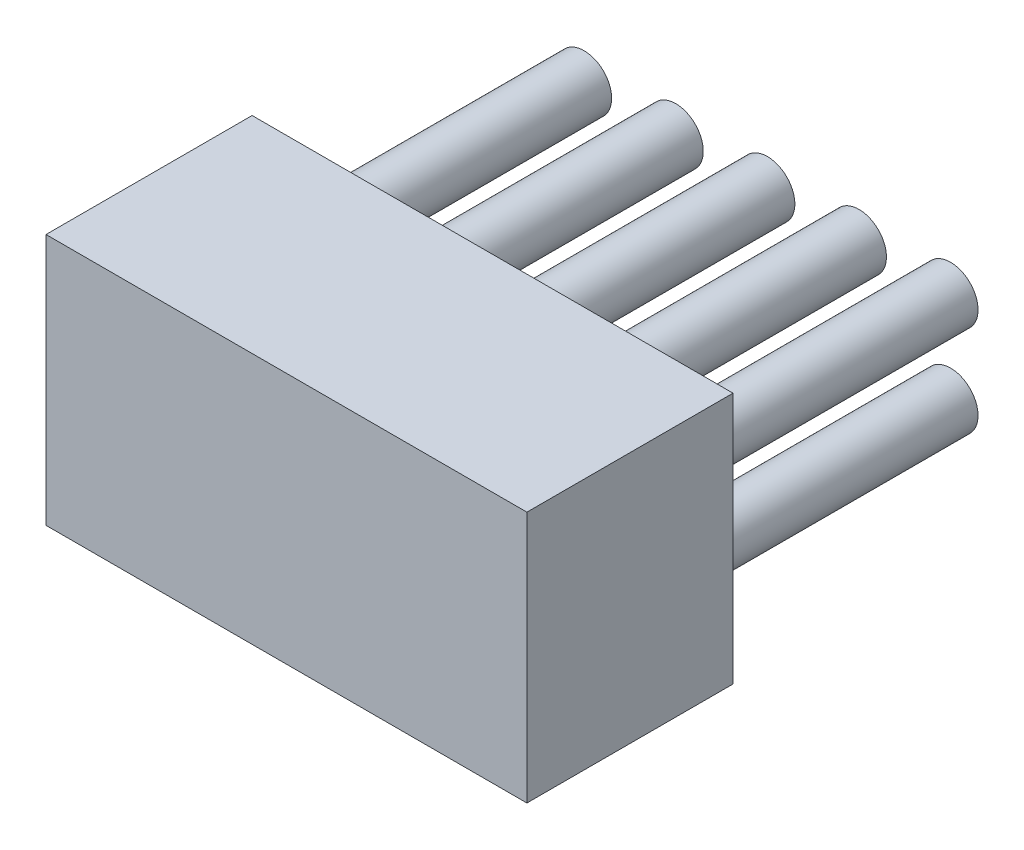
ISO-10303-21;
HEADER;
FILE_DESCRIPTION(('STEP AP214'),'2;1');
FILE_NAME('part.step','',(''),(''),'','','');
FILE_SCHEMA(('AUTOMOTIVE_DESIGN { 1 0 10303 214 1 1 1 1 }'));
ENDSEC;
DATA;
#1=APPLICATION_CONTEXT('core data for automotive mechanical design processes');
#2=APPLICATION_PROTOCOL_DEFINITION('international standard','automotive_design',2000,#1);
#3=PRODUCT_CONTEXT('',#1,'mechanical');
#4=PRODUCT('Part','Part','',(#3));
#5=PRODUCT_RELATED_PRODUCT_CATEGORY('part','',(#4));
#6=PRODUCT_DEFINITION_FORMATION('','',#4);
#7=PRODUCT_DEFINITION_CONTEXT('part definition',#1,'design');
#8=PRODUCT_DEFINITION('design','',#6,#7);
#9=PRODUCT_DEFINITION_SHAPE('','',#8);
#10=(LENGTH_UNIT() NAMED_UNIT(*) SI_UNIT(.MILLI.,.METRE.));
#11=(NAMED_UNIT(*) PLANE_ANGLE_UNIT() SI_UNIT($,.RADIAN.));
#12=(NAMED_UNIT(*) SI_UNIT($,.STERADIAN.) SOLID_ANGLE_UNIT());
#13=UNCERTAINTY_MEASURE_WITH_UNIT(LENGTH_MEASURE(1.E-05),#10,'distance_accuracy_value','');
#14=(GEOMETRIC_REPRESENTATION_CONTEXT(3) GLOBAL_UNCERTAINTY_ASSIGNED_CONTEXT((#13)) GLOBAL_UNIT_ASSIGNED_CONTEXT((#10,
#11,#12)) REPRESENTATION_CONTEXT('',''));
#15=CARTESIAN_POINT('',(0.,0.,0.));
#16=DIRECTION('',(0.,0.,1.));
#17=DIRECTION('',(1.,0.,0.));
#18=AXIS2_PLACEMENT_3D('',#15,#16,#17);
#19=CARTESIAN_POINT('',(0.,0.,4.5));
#20=DIRECTION('',(1.,0.,0.));
#21=DIRECTION('',(0.,0.,-1.));
#22=AXIS2_PLACEMENT_3D('',#19,#20,#21);
#23=PLANE('',#22);
#24=DIRECTION('',(0.,-1.,0.));
#25=VECTOR('',#24,1.);
#26=CARTESIAN_POINT('',(0.,0.,0.));
#27=LINE('',#26,#25);
#28=CARTESIAN_POINT('',(0.,5.5,0.));
#29=VERTEX_POINT('',#28);
#30=CARTESIAN_POINT('',(0.,0.,0.));
#31=VERTEX_POINT('',#30);
#32=EDGE_CURVE('E97',#29,#31,#27,.T.);
#33=ORIENTED_EDGE('',*,*,#32,.T.);
#34=DIRECTION('',(0.,0.,-1.));
#35=VECTOR('',#34,1.);
#36=CARTESIAN_POINT('',(0.,0.,4.5));
#37=LINE('',#36,#35);
#38=CARTESIAN_POINT('',(0.,0.,4.5));
#39=VERTEX_POINT('',#38);
#40=EDGE_CURVE('E11',#39,#31,#37,.T.);
#41=ORIENTED_EDGE('',*,*,#40,.F.);
#42=DIRECTION('',(0.,-1.,0.));
#43=VECTOR('',#42,1.);
#44=CARTESIAN_POINT('',(0.,0.,4.5));
#45=LINE('',#44,#43);
#46=CARTESIAN_POINT('',(0.,5.5,4.5));
#47=VERTEX_POINT('',#46);
#48=EDGE_CURVE('E85',#47,#39,#45,.T.);
#49=ORIENTED_EDGE('',*,*,#48,.F.);
#50=DIRECTION('',(0.,0.,-1.));
#51=VECTOR('',#50,1.);
#52=CARTESIAN_POINT('',(0.,5.5,4.5));
#53=LINE('',#52,#51);
#54=EDGE_CURVE('E93',#47,#29,#53,.T.);
#55=ORIENTED_EDGE('',*,*,#54,.T.);
#56=EDGE_LOOP('',(#33,#41,#49,#55));
#57=FACE_BOUND('',#56,.T.);
#58=ADVANCED_FACE('F34',(#57),#23,.F.);
#59=CARTESIAN_POINT('',(0.,0.,4.5));
#60=DIRECTION('',(0.,1.,0.));
#61=DIRECTION('',(0.,0.,1.));
#62=AXIS2_PLACEMENT_3D('',#59,#60,#61);
#63=PLANE('',#62);
#64=DIRECTION('',(1.,0.,0.));
#65=VECTOR('',#64,1.);
#66=CARTESIAN_POINT('',(0.,0.,0.));
#67=LINE('',#66,#65);
#68=CARTESIAN_POINT('',(10.5,0.,0.));
#69=VERTEX_POINT('',#68);
#70=EDGE_CURVE('E89',#31,#69,#67,.T.);
#71=ORIENTED_EDGE('',*,*,#70,.T.);
#72=DIRECTION('',(0.,0.,-1.));
#73=VECTOR('',#72,1.);
#74=CARTESIAN_POINT('',(10.5,0.,4.5));
#75=LINE('',#74,#73);
#76=CARTESIAN_POINT('',(10.5,0.,4.5));
#77=VERTEX_POINT('',#76);
#78=EDGE_CURVE('E42',#77,#69,#75,.T.);
#79=ORIENTED_EDGE('',*,*,#78,.F.);
#80=DIRECTION('',(1.,0.,0.));
#81=VECTOR('',#80,1.);
#82=CARTESIAN_POINT('',(0.,0.,4.5));
#83=LINE('',#82,#81);
#84=EDGE_CURVE('E80',#39,#77,#83,.T.);
#85=ORIENTED_EDGE('',*,*,#84,.F.);
#86=ORIENTED_EDGE('',*,*,#40,.T.);
#87=EDGE_LOOP('',(#71,#79,#85,#86));
#88=FACE_BOUND('',#87,.T.);
#89=ADVANCED_FACE('F88',(#88),#63,.F.);
#90=CARTESIAN_POINT('',(10.5,0.,4.5));
#91=DIRECTION('',(-1.,0.,0.));
#92=DIRECTION('',(0.,0.,1.));
#93=AXIS2_PLACEMENT_3D('',#90,#91,#92);
#94=PLANE('',#93);
#95=DIRECTION('',(0.,1.,0.));
#96=VECTOR('',#95,1.);
#97=CARTESIAN_POINT('',(10.5,0.,0.));
#98=LINE('',#97,#96);
#99=CARTESIAN_POINT('',(10.5,5.5,0.));
#100=VERTEX_POINT('',#99);
#101=EDGE_CURVE('E67',#69,#100,#98,.T.);
#102=ORIENTED_EDGE('',*,*,#101,.T.);
#103=DIRECTION('',(0.,0.,-1.));
#104=VECTOR('',#103,1.);
#105=CARTESIAN_POINT('',(10.5,5.5,4.5));
#106=LINE('',#105,#104);
#107=CARTESIAN_POINT('',(10.5,5.5,4.5));
#108=VERTEX_POINT('',#107);
#109=EDGE_CURVE('E90',#108,#100,#106,.T.);
#110=ORIENTED_EDGE('',*,*,#109,.F.);
#111=DIRECTION('',(0.,1.,0.));
#112=VECTOR('',#111,1.);
#113=CARTESIAN_POINT('',(10.5,0.,4.5));
#114=LINE('',#113,#112);
#115=EDGE_CURVE('E83',#77,#108,#114,.T.);
#116=ORIENTED_EDGE('',*,*,#115,.F.);
#117=ORIENTED_EDGE('',*,*,#78,.T.);
#118=EDGE_LOOP('',(#102,#110,#116,#117));
#119=FACE_BOUND('',#118,.T.);
#120=ADVANCED_FACE('F91',(#119),#94,.F.);
#121=CARTESIAN_POINT('',(0.,5.5,4.5));
#122=DIRECTION('',(0.,-1.,0.));
#123=DIRECTION('',(0.,0.,-1.));
#124=AXIS2_PLACEMENT_3D('',#121,#122,#123);
#125=PLANE('',#124);
#126=DIRECTION('',(-1.,0.,0.));
#127=VECTOR('',#126,1.);
#128=CARTESIAN_POINT('',(0.,5.5,0.));
#129=LINE('',#128,#127);
#130=EDGE_CURVE('E73',#100,#29,#129,.T.);
#131=ORIENTED_EDGE('',*,*,#130,.T.);
#132=ORIENTED_EDGE('',*,*,#54,.F.);
#133=DIRECTION('',(-1.,0.,0.));
#134=VECTOR('',#133,1.);
#135=CARTESIAN_POINT('',(0.,5.5,4.5));
#136=LINE('',#135,#134);
#137=EDGE_CURVE('E50',#108,#47,#136,.T.);
#138=ORIENTED_EDGE('',*,*,#137,.F.);
#139=ORIENTED_EDGE('',*,*,#109,.T.);
#140=EDGE_LOOP('',(#131,#132,#138,#139));
#141=FACE_BOUND('',#140,.T.);
#142=ADVANCED_FACE('F105',(#141),#125,.F.);
#143=CARTESIAN_POINT('',(0.,0.,4.5));
#144=DIRECTION('',(0.,0.,-1.));
#145=DIRECTION('',(-1.,0.,0.));
#146=AXIS2_PLACEMENT_3D('',#143,#144,#145);
#147=PLANE('',#146);
#148=ORIENTED_EDGE('',*,*,#48,.T.);
#149=ORIENTED_EDGE('',*,*,#84,.T.);
#150=ORIENTED_EDGE('',*,*,#115,.T.);
#151=ORIENTED_EDGE('',*,*,#137,.T.);
#152=EDGE_LOOP('',(#148,#149,#150,#151));
#153=FACE_BOUND('',#152,.T.);
#154=ADVANCED_FACE('F81',(#153),#147,.F.);
#155=CARTESIAN_POINT('',(0.,0.,0.));
#156=DIRECTION('',(0.,0.,-1.));
#157=DIRECTION('',(-1.,0.,0.));
#158=AXIS2_PLACEMENT_3D('',#155,#156,#157);
#159=PLANE('',#158);
#160=CARTESIAN_POINT('',(3.25,1.75,0.));
#161=DIRECTION('',(0.,0.,-1.));
#162=DIRECTION('',(-1.,0.,0.));
#163=AXIS2_PLACEMENT_3D('',#160,#161,#162);
#164=CIRCLE('',#163,0.6);
#165=CARTESIAN_POINT('',(2.65,1.75,0.));
#166=VERTEX_POINT('',#165);
#167=EDGE_CURVE('E165',#166,#166,#164,.T.);
#168=ORIENTED_EDGE('',*,*,#167,.F.);
#169=EDGE_LOOP('',(#168));
#170=FACE_BOUND('',#169,.T.);
#171=CARTESIAN_POINT('',(1.25,1.75,0.));
#172=DIRECTION('',(0.,0.,-1.));
#173=DIRECTION('',(-1.,0.,0.));
#174=AXIS2_PLACEMENT_3D('',#171,#172,#173);
#175=CIRCLE('',#174,0.6);
#176=CARTESIAN_POINT('',(0.649999999999999,1.75,0.));
#177=VERTEX_POINT('',#176);
#178=EDGE_CURVE('E159',#177,#177,#175,.T.);
#179=ORIENTED_EDGE('',*,*,#178,.F.);
#180=EDGE_LOOP('',(#179));
#181=FACE_BOUND('',#180,.T.);
#182=CARTESIAN_POINT('',(1.25,3.75,0.));
#183=DIRECTION('',(0.,0.,-1.));
#184=DIRECTION('',(-1.,0.,0.));
#185=AXIS2_PLACEMENT_3D('',#182,#183,#184);
#186=CIRCLE('',#185,0.6);
#187=CARTESIAN_POINT('',(0.649999999999999,3.75,0.));
#188=VERTEX_POINT('',#187);
#189=EDGE_CURVE('E153',#188,#188,#186,.T.);
#190=ORIENTED_EDGE('',*,*,#189,.F.);
#191=EDGE_LOOP('',(#190));
#192=FACE_BOUND('',#191,.T.);
#193=CARTESIAN_POINT('',(3.25,3.75,0.));
#194=DIRECTION('',(0.,0.,-1.));
#195=DIRECTION('',(-1.,0.,0.));
#196=AXIS2_PLACEMENT_3D('',#193,#194,#195);
#197=CIRCLE('',#196,0.6);
#198=CARTESIAN_POINT('',(2.65,3.75,0.));
#199=VERTEX_POINT('',#198);
#200=EDGE_CURVE('E147',#199,#199,#197,.T.);
#201=ORIENTED_EDGE('',*,*,#200,.F.);
#202=EDGE_LOOP('',(#201));
#203=FACE_BOUND('',#202,.T.);
#204=CARTESIAN_POINT('',(5.25,3.75,0.));
#205=DIRECTION('',(0.,0.,-1.));
#206=DIRECTION('',(-1.,0.,0.));
#207=AXIS2_PLACEMENT_3D('',#204,#205,#206);
#208=CIRCLE('',#207,0.6);
#209=CARTESIAN_POINT('',(4.65,3.75,0.));
#210=VERTEX_POINT('',#209);
#211=EDGE_CURVE('E141',#210,#210,#208,.T.);
#212=ORIENTED_EDGE('',*,*,#211,.F.);
#213=EDGE_LOOP('',(#212));
#214=FACE_BOUND('',#213,.T.);
#215=CARTESIAN_POINT('',(7.25,3.75,0.));
#216=DIRECTION('',(0.,0.,-1.));
#217=DIRECTION('',(-1.,0.,0.));
#218=AXIS2_PLACEMENT_3D('',#215,#216,#217);
#219=CIRCLE('',#218,0.6);
#220=CARTESIAN_POINT('',(6.65,3.75,0.));
#221=VERTEX_POINT('',#220);
#222=EDGE_CURVE('E135',#221,#221,#219,.T.);
#223=ORIENTED_EDGE('',*,*,#222,.F.);
#224=EDGE_LOOP('',(#223));
#225=FACE_BOUND('',#224,.T.);
#226=CARTESIAN_POINT('',(7.25,1.75,0.));
#227=DIRECTION('',(0.,0.,-1.));
#228=DIRECTION('',(-1.,0.,0.));
#229=AXIS2_PLACEMENT_3D('',#226,#227,#228);
#230=CIRCLE('',#229,0.6);
#231=CARTESIAN_POINT('',(6.65,1.75,0.));
#232=VERTEX_POINT('',#231);
#233=EDGE_CURVE('E129',#232,#232,#230,.T.);
#234=ORIENTED_EDGE('',*,*,#233,.F.);
#235=EDGE_LOOP('',(#234));
#236=FACE_BOUND('',#235,.T.);
#237=CARTESIAN_POINT('',(5.25,1.75,0.));
#238=DIRECTION('',(0.,0.,-1.));
#239=DIRECTION('',(-1.,0.,0.));
#240=AXIS2_PLACEMENT_3D('',#237,#238,#239);
#241=CIRCLE('',#240,0.6);
#242=CARTESIAN_POINT('',(4.65,1.75,0.));
#243=VERTEX_POINT('',#242);
#244=EDGE_CURVE('E123',#243,#243,#241,.T.);
#245=ORIENTED_EDGE('',*,*,#244,.F.);
#246=EDGE_LOOP('',(#245));
#247=FACE_BOUND('',#246,.T.);
#248=CARTESIAN_POINT('',(9.25,3.75,0.));
#249=DIRECTION('',(0.,0.,-1.));
#250=DIRECTION('',(-1.,0.,0.));
#251=AXIS2_PLACEMENT_3D('',#248,#249,#250);
#252=CIRCLE('',#251,0.6);
#253=CARTESIAN_POINT('',(8.65,3.75,0.));
#254=VERTEX_POINT('',#253);
#255=EDGE_CURVE('E117',#254,#254,#252,.T.);
#256=ORIENTED_EDGE('',*,*,#255,.F.);
#257=EDGE_LOOP('',(#256));
#258=FACE_BOUND('',#257,.T.);
#259=CARTESIAN_POINT('',(9.25,1.75,0.));
#260=DIRECTION('',(0.,0.,-1.));
#261=DIRECTION('',(-1.,0.,0.));
#262=AXIS2_PLACEMENT_3D('',#259,#260,#261);
#263=CIRCLE('',#262,0.6);
#264=CARTESIAN_POINT('',(8.65,1.75,0.));
#265=VERTEX_POINT('',#264);
#266=EDGE_CURVE('E111',#265,#265,#263,.T.);
#267=ORIENTED_EDGE('',*,*,#266,.F.);
#268=EDGE_LOOP('',(#267));
#269=FACE_BOUND('',#268,.T.);
#270=ORIENTED_EDGE('',*,*,#32,.F.);
#271=ORIENTED_EDGE('',*,*,#130,.F.);
#272=ORIENTED_EDGE('',*,*,#101,.F.);
#273=ORIENTED_EDGE('',*,*,#70,.F.);
#274=EDGE_LOOP('',(#270,#271,#272,#273));
#275=FACE_BOUND('',#274,.T.);
#276=ADVANCED_FACE('F108',(#170,#181,#192,#203,#214,#225,#236,#247,#258,#269,#275),#159,.T.);
#277=CARTESIAN_POINT('',(9.25,1.75,-6.));
#278=DIRECTION('',(0.,0.,1.));
#279=DIRECTION('',(1.,0.,0.));
#280=AXIS2_PLACEMENT_3D('',#277,#278,#279);
#281=CYLINDRICAL_SURFACE('',#280,0.6);
#282=CARTESIAN_POINT('',(9.25,1.75,-6.));
#283=DIRECTION('',(0.,0.,-1.));
#284=DIRECTION('',(-1.,0.,0.));
#285=AXIS2_PLACEMENT_3D('',#282,#283,#284);
#286=CIRCLE('',#285,0.6);
#287=CARTESIAN_POINT('',(8.65,1.75,-6.));
#288=VERTEX_POINT('',#287);
#289=EDGE_CURVE('E100',#288,#288,#286,.T.);
#290=ORIENTED_EDGE('',*,*,#289,.F.);
#291=EDGE_LOOP('',(#290));
#292=FACE_BOUND('',#291,.T.);
#293=ORIENTED_EDGE('',*,*,#266,.T.);
#294=EDGE_LOOP('',(#293));
#295=FACE_BOUND('',#294,.T.);
#296=ADVANCED_FACE('F182',(#292,#295),#281,.T.);
#297=CARTESIAN_POINT('',(9.25,1.75,-6.));
#298=DIRECTION('',(0.,0.,-1.));
#299=DIRECTION('',(-1.,0.,0.));
#300=AXIS2_PLACEMENT_3D('',#297,#298,#299);
#301=PLANE('',#300);
#302=ORIENTED_EDGE('',*,*,#289,.T.);
#303=EDGE_LOOP('',(#302));
#304=FACE_BOUND('',#303,.T.);
#305=ADVANCED_FACE('F203',(#304),#301,.T.);
#306=CARTESIAN_POINT('',(9.25,3.75,-6.));
#307=DIRECTION('',(0.,0.,1.));
#308=DIRECTION('',(1.,0.,0.));
#309=AXIS2_PLACEMENT_3D('',#306,#307,#308);
#310=CYLINDRICAL_SURFACE('',#309,0.6);
#311=CARTESIAN_POINT('',(9.25,3.75,-6.));
#312=DIRECTION('',(0.,0.,-1.));
#313=DIRECTION('',(-1.,0.,0.));
#314=AXIS2_PLACEMENT_3D('',#311,#312,#313);
#315=CIRCLE('',#314,0.6);
#316=CARTESIAN_POINT('',(8.65,3.75,-6.));
#317=VERTEX_POINT('',#316);
#318=EDGE_CURVE('E114',#317,#317,#315,.T.);
#319=ORIENTED_EDGE('',*,*,#318,.F.);
#320=EDGE_LOOP('',(#319));
#321=FACE_BOUND('',#320,.T.);
#322=ORIENTED_EDGE('',*,*,#255,.T.);
#323=EDGE_LOOP('',(#322));
#324=FACE_BOUND('',#323,.T.);
#325=ADVANCED_FACE('F209',(#321,#324),#310,.T.);
#326=CARTESIAN_POINT('',(9.25,3.75,-6.));
#327=DIRECTION('',(0.,0.,-1.));
#328=DIRECTION('',(-1.,0.,0.));
#329=AXIS2_PLACEMENT_3D('',#326,#327,#328);
#330=PLANE('',#329);
#331=ORIENTED_EDGE('',*,*,#318,.T.);
#332=EDGE_LOOP('',(#331));
#333=FACE_BOUND('',#332,.T.);
#334=ADVANCED_FACE('F252',(#333),#330,.T.);
#335=CARTESIAN_POINT('',(5.25,1.75,-6.));
#336=DIRECTION('',(0.,0.,1.));
#337=DIRECTION('',(1.,0.,0.));
#338=AXIS2_PLACEMENT_3D('',#335,#336,#337);
#339=CYLINDRICAL_SURFACE('',#338,0.6);
#340=CARTESIAN_POINT('',(5.25,1.75,-6.));
#341=DIRECTION('',(0.,0.,-1.));
#342=DIRECTION('',(-1.,0.,0.));
#343=AXIS2_PLACEMENT_3D('',#340,#341,#342);
#344=CIRCLE('',#343,0.6);
#345=CARTESIAN_POINT('',(4.65,1.75,-6.));
#346=VERTEX_POINT('',#345);
#347=EDGE_CURVE('E120',#346,#346,#344,.T.);
#348=ORIENTED_EDGE('',*,*,#347,.F.);
#349=EDGE_LOOP('',(#348));
#350=FACE_BOUND('',#349,.T.);
#351=ORIENTED_EDGE('',*,*,#244,.T.);
#352=EDGE_LOOP('',(#351));
#353=FACE_BOUND('',#352,.T.);
#354=ADVANCED_FACE('F262',(#350,#353),#339,.T.);
#355=CARTESIAN_POINT('',(5.25,1.75,-6.));
#356=DIRECTION('',(0.,0.,-1.));
#357=DIRECTION('',(-1.,0.,0.));
#358=AXIS2_PLACEMENT_3D('',#355,#356,#357);
#359=PLANE('',#358);
#360=ORIENTED_EDGE('',*,*,#347,.T.);
#361=EDGE_LOOP('',(#360));
#362=FACE_BOUND('',#361,.T.);
#363=ADVANCED_FACE('F272',(#362),#359,.T.);
#364=CARTESIAN_POINT('',(7.25,1.75,-6.));
#365=DIRECTION('',(0.,0.,1.));
#366=DIRECTION('',(1.,0.,0.));
#367=AXIS2_PLACEMENT_3D('',#364,#365,#366);
#368=CYLINDRICAL_SURFACE('',#367,0.6);
#369=CARTESIAN_POINT('',(7.25,1.75,-6.));
#370=DIRECTION('',(0.,0.,-1.));
#371=DIRECTION('',(-1.,0.,0.));
#372=AXIS2_PLACEMENT_3D('',#369,#370,#371);
#373=CIRCLE('',#372,0.6);
#374=CARTESIAN_POINT('',(6.65,1.75,-6.));
#375=VERTEX_POINT('',#374);
#376=EDGE_CURVE('E126',#375,#375,#373,.T.);
#377=ORIENTED_EDGE('',*,*,#376,.F.);
#378=EDGE_LOOP('',(#377));
#379=FACE_BOUND('',#378,.T.);
#380=ORIENTED_EDGE('',*,*,#233,.T.);
#381=EDGE_LOOP('',(#380));
#382=FACE_BOUND('',#381,.T.);
#383=ADVANCED_FACE('F282',(#379,#382),#368,.T.);
#384=CARTESIAN_POINT('',(7.25,1.75,-6.));
#385=DIRECTION('',(0.,0.,-1.));
#386=DIRECTION('',(-1.,0.,0.));
#387=AXIS2_PLACEMENT_3D('',#384,#385,#386);
#388=PLANE('',#387);
#389=ORIENTED_EDGE('',*,*,#376,.T.);
#390=EDGE_LOOP('',(#389));
#391=FACE_BOUND('',#390,.T.);
#392=ADVANCED_FACE('F292',(#391),#388,.T.);
#393=CARTESIAN_POINT('',(7.25,3.75,-6.));
#394=DIRECTION('',(0.,0.,1.));
#395=DIRECTION('',(1.,0.,0.));
#396=AXIS2_PLACEMENT_3D('',#393,#394,#395);
#397=CYLINDRICAL_SURFACE('',#396,0.6);
#398=CARTESIAN_POINT('',(7.25,3.75,-6.));
#399=DIRECTION('',(0.,0.,-1.));
#400=DIRECTION('',(-1.,0.,0.));
#401=AXIS2_PLACEMENT_3D('',#398,#399,#400);
#402=CIRCLE('',#401,0.6);
#403=CARTESIAN_POINT('',(6.65,3.75,-6.));
#404=VERTEX_POINT('',#403);
#405=EDGE_CURVE('E132',#404,#404,#402,.T.);
#406=ORIENTED_EDGE('',*,*,#405,.F.);
#407=EDGE_LOOP('',(#406));
#408=FACE_BOUND('',#407,.T.);
#409=ORIENTED_EDGE('',*,*,#222,.T.);
#410=EDGE_LOOP('',(#409));
#411=FACE_BOUND('',#410,.T.);
#412=ADVANCED_FACE('F302',(#408,#411),#397,.T.);
#413=CARTESIAN_POINT('',(7.25,3.75,-6.));
#414=DIRECTION('',(0.,0.,-1.));
#415=DIRECTION('',(-1.,0.,0.));
#416=AXIS2_PLACEMENT_3D('',#413,#414,#415);
#417=PLANE('',#416);
#418=ORIENTED_EDGE('',*,*,#405,.T.);
#419=EDGE_LOOP('',(#418));
#420=FACE_BOUND('',#419,.T.);
#421=ADVANCED_FACE('F312',(#420),#417,.T.);
#422=CARTESIAN_POINT('',(5.25,3.75,-6.));
#423=DIRECTION('',(0.,0.,1.));
#424=DIRECTION('',(1.,0.,0.));
#425=AXIS2_PLACEMENT_3D('',#422,#423,#424);
#426=CYLINDRICAL_SURFACE('',#425,0.6);
#427=CARTESIAN_POINT('',(5.25,3.75,-6.));
#428=DIRECTION('',(0.,0.,-1.));
#429=DIRECTION('',(-1.,0.,0.));
#430=AXIS2_PLACEMENT_3D('',#427,#428,#429);
#431=CIRCLE('',#430,0.6);
#432=CARTESIAN_POINT('',(4.65,3.75,-6.));
#433=VERTEX_POINT('',#432);
#434=EDGE_CURVE('E138',#433,#433,#431,.T.);
#435=ORIENTED_EDGE('',*,*,#434,.F.);
#436=EDGE_LOOP('',(#435));
#437=FACE_BOUND('',#436,.T.);
#438=ORIENTED_EDGE('',*,*,#211,.T.);
#439=EDGE_LOOP('',(#438));
#440=FACE_BOUND('',#439,.T.);
#441=ADVANCED_FACE('F322',(#437,#440),#426,.T.);
#442=CARTESIAN_POINT('',(5.25,3.75,-6.));
#443=DIRECTION('',(0.,0.,-1.));
#444=DIRECTION('',(-1.,0.,0.));
#445=AXIS2_PLACEMENT_3D('',#442,#443,#444);
#446=PLANE('',#445);
#447=ORIENTED_EDGE('',*,*,#434,.T.);
#448=EDGE_LOOP('',(#447));
#449=FACE_BOUND('',#448,.T.);
#450=ADVANCED_FACE('F332',(#449),#446,.T.);
#451=CARTESIAN_POINT('',(3.25,3.75,-6.));
#452=DIRECTION('',(0.,0.,1.));
#453=DIRECTION('',(1.,0.,0.));
#454=AXIS2_PLACEMENT_3D('',#451,#452,#453);
#455=CYLINDRICAL_SURFACE('',#454,0.6);
#456=CARTESIAN_POINT('',(3.25,3.75,-6.));
#457=DIRECTION('',(0.,0.,-1.));
#458=DIRECTION('',(-1.,0.,0.));
#459=AXIS2_PLACEMENT_3D('',#456,#457,#458);
#460=CIRCLE('',#459,0.6);
#461=CARTESIAN_POINT('',(2.65,3.75,-6.));
#462=VERTEX_POINT('',#461);
#463=EDGE_CURVE('E144',#462,#462,#460,.T.);
#464=ORIENTED_EDGE('',*,*,#463,.F.);
#465=EDGE_LOOP('',(#464));
#466=FACE_BOUND('',#465,.T.);
#467=ORIENTED_EDGE('',*,*,#200,.T.);
#468=EDGE_LOOP('',(#467));
#469=FACE_BOUND('',#468,.T.);
#470=ADVANCED_FACE('F342',(#466,#469),#455,.T.);
#471=CARTESIAN_POINT('',(3.25,3.75,-6.));
#472=DIRECTION('',(0.,0.,-1.));
#473=DIRECTION('',(-1.,0.,0.));
#474=AXIS2_PLACEMENT_3D('',#471,#472,#473);
#475=PLANE('',#474);
#476=ORIENTED_EDGE('',*,*,#463,.T.);
#477=EDGE_LOOP('',(#476));
#478=FACE_BOUND('',#477,.T.);
#479=ADVANCED_FACE('F352',(#478),#475,.T.);
#480=CARTESIAN_POINT('',(1.25,3.75,-6.));
#481=DIRECTION('',(0.,0.,1.));
#482=DIRECTION('',(1.,0.,0.));
#483=AXIS2_PLACEMENT_3D('',#480,#481,#482);
#484=CYLINDRICAL_SURFACE('',#483,0.6);
#485=CARTESIAN_POINT('',(1.25,3.75,-6.));
#486=DIRECTION('',(0.,0.,-1.));
#487=DIRECTION('',(-1.,0.,0.));
#488=AXIS2_PLACEMENT_3D('',#485,#486,#487);
#489=CIRCLE('',#488,0.6);
#490=CARTESIAN_POINT('',(0.649999999999999,3.75,-6.));
#491=VERTEX_POINT('',#490);
#492=EDGE_CURVE('E150',#491,#491,#489,.T.);
#493=ORIENTED_EDGE('',*,*,#492,.F.);
#494=EDGE_LOOP('',(#493));
#495=FACE_BOUND('',#494,.T.);
#496=ORIENTED_EDGE('',*,*,#189,.T.);
#497=EDGE_LOOP('',(#496));
#498=FACE_BOUND('',#497,.T.);
#499=ADVANCED_FACE('F362',(#495,#498),#484,.T.);
#500=CARTESIAN_POINT('',(1.25,3.75,-6.));
#501=DIRECTION('',(0.,0.,-1.));
#502=DIRECTION('',(-1.,0.,0.));
#503=AXIS2_PLACEMENT_3D('',#500,#501,#502);
#504=PLANE('',#503);
#505=ORIENTED_EDGE('',*,*,#492,.T.);
#506=EDGE_LOOP('',(#505));
#507=FACE_BOUND('',#506,.T.);
#508=ADVANCED_FACE('F372',(#507),#504,.T.);
#509=CARTESIAN_POINT('',(1.25,1.75,-6.));
#510=DIRECTION('',(0.,0.,1.));
#511=DIRECTION('',(1.,0.,0.));
#512=AXIS2_PLACEMENT_3D('',#509,#510,#511);
#513=CYLINDRICAL_SURFACE('',#512,0.6);
#514=CARTESIAN_POINT('',(1.25,1.75,-6.));
#515=DIRECTION('',(0.,0.,-1.));
#516=DIRECTION('',(-1.,0.,0.));
#517=AXIS2_PLACEMENT_3D('',#514,#515,#516);
#518=CIRCLE('',#517,0.6);
#519=CARTESIAN_POINT('',(0.649999999999999,1.75,-6.));
#520=VERTEX_POINT('',#519);
#521=EDGE_CURVE('E156',#520,#520,#518,.T.);
#522=ORIENTED_EDGE('',*,*,#521,.F.);
#523=EDGE_LOOP('',(#522));
#524=FACE_BOUND('',#523,.T.);
#525=ORIENTED_EDGE('',*,*,#178,.T.);
#526=EDGE_LOOP('',(#525));
#527=FACE_BOUND('',#526,.T.);
#528=ADVANCED_FACE('F382',(#524,#527),#513,.T.);
#529=CARTESIAN_POINT('',(1.25,1.75,-6.));
#530=DIRECTION('',(0.,0.,-1.));
#531=DIRECTION('',(-1.,0.,0.));
#532=AXIS2_PLACEMENT_3D('',#529,#530,#531);
#533=PLANE('',#532);
#534=ORIENTED_EDGE('',*,*,#521,.T.);
#535=EDGE_LOOP('',(#534));
#536=FACE_BOUND('',#535,.T.);
#537=ADVANCED_FACE('F176',(#536),#533,.T.);
#538=CARTESIAN_POINT('',(3.25,1.75,-6.));
#539=DIRECTION('',(0.,0.,1.));
#540=DIRECTION('',(1.,0.,0.));
#541=AXIS2_PLACEMENT_3D('',#538,#539,#540);
#542=CYLINDRICAL_SURFACE('',#541,0.6);
#543=CARTESIAN_POINT('',(3.25,1.75,-6.));
#544=DIRECTION('',(0.,0.,-1.));
#545=DIRECTION('',(-1.,0.,0.));
#546=AXIS2_PLACEMENT_3D('',#543,#544,#545);
#547=CIRCLE('',#546,0.6);
#548=CARTESIAN_POINT('',(2.65,1.75,-6.));
#549=VERTEX_POINT('',#548);
#550=EDGE_CURVE('E162',#549,#549,#547,.T.);
#551=ORIENTED_EDGE('',*,*,#550,.F.);
#552=EDGE_LOOP('',(#551));
#553=FACE_BOUND('',#552,.T.);
#554=ORIENTED_EDGE('',*,*,#167,.T.);
#555=EDGE_LOOP('',(#554));
#556=FACE_BOUND('',#555,.T.);
#557=ADVANCED_FACE('F173',(#553,#556),#542,.T.);
#558=CARTESIAN_POINT('',(3.25,1.75,-6.));
#559=DIRECTION('',(0.,0.,-1.));
#560=DIRECTION('',(-1.,0.,0.));
#561=AXIS2_PLACEMENT_3D('',#558,#559,#560);
#562=PLANE('',#561);
#563=ORIENTED_EDGE('',*,*,#550,.T.);
#564=EDGE_LOOP('',(#563));
#565=FACE_BOUND('',#564,.T.);
#566=ADVANCED_FACE('F171',(#565),#562,.T.);
#567=CLOSED_SHELL('',(#58,#89,#120,#142,#154,#276,#296,#305,#325,#334,#354,#363,#383,#392,#412,
#421,#441,#450,#470,#479,#499,#508,#528,#537,#557,#566));
#568=MANIFOLD_SOLID_BREP('B2',#567);
#569=ADVANCED_BREP_SHAPE_REPRESENTATION('',(#18,#568),#14);
#570=SHAPE_DEFINITION_REPRESENTATION(#9,#569);
ENDSEC;
END-ISO-10303-21;
